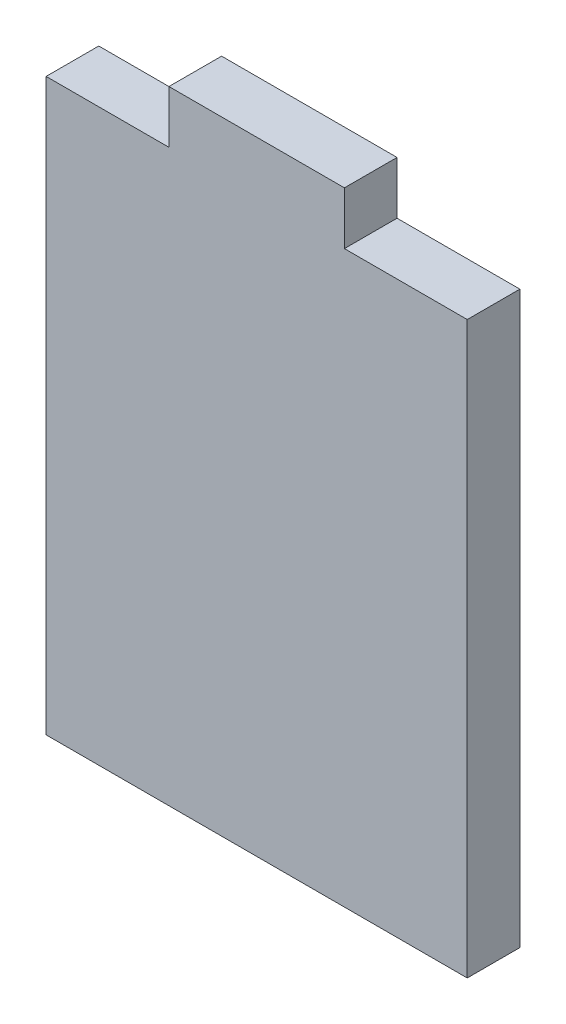
ISO-10303-21;
HEADER;
FILE_DESCRIPTION(('STEP AP214'),'2;1');
FILE_NAME('part.step','',(''),(''),'','','');
FILE_SCHEMA(('AUTOMOTIVE_DESIGN { 1 0 10303 214 1 1 1 1 }'));
ENDSEC;
DATA;
#1=APPLICATION_CONTEXT('core data for automotive mechanical design processes');
#2=APPLICATION_PROTOCOL_DEFINITION('international standard','automotive_design',2000,#1);
#3=PRODUCT_CONTEXT('',#1,'mechanical');
#4=PRODUCT('Part','Part','',(#3));
#5=PRODUCT_RELATED_PRODUCT_CATEGORY('part','',(#4));
#6=PRODUCT_DEFINITION_FORMATION('','',#4);
#7=PRODUCT_DEFINITION_CONTEXT('part definition',#1,'design');
#8=PRODUCT_DEFINITION('design','',#6,#7);
#9=PRODUCT_DEFINITION_SHAPE('','',#8);
#10=(LENGTH_UNIT() NAMED_UNIT(*) SI_UNIT(.MILLI.,.METRE.));
#11=(NAMED_UNIT(*) PLANE_ANGLE_UNIT() SI_UNIT($,.RADIAN.));
#12=(NAMED_UNIT(*) SI_UNIT($,.STERADIAN.) SOLID_ANGLE_UNIT());
#13=UNCERTAINTY_MEASURE_WITH_UNIT(LENGTH_MEASURE(1.E-05),#10,'distance_accuracy_value','');
#14=(GEOMETRIC_REPRESENTATION_CONTEXT(3) GLOBAL_UNCERTAINTY_ASSIGNED_CONTEXT((#13)) GLOBAL_UNIT_ASSIGNED_CONTEXT((#10,
#11,#12)) REPRESENTATION_CONTEXT('',''));
#15=CARTESIAN_POINT('',(0.,0.,0.));
#16=DIRECTION('',(0.,0.,1.));
#17=DIRECTION('',(1.,0.,0.));
#18=AXIS2_PLACEMENT_3D('',#15,#16,#17);
#19=CARTESIAN_POINT('',(-53.4278333333333,35.3166666666667,6.));
#20=DIRECTION('',(0.,-1.,0.));
#21=DIRECTION('',(0.,0.,-1.));
#22=AXIS2_PLACEMENT_3D('',#19,#20,#21);
#23=PLANE('',#22);
#24=DIRECTION('',(0.,0.,1.));
#25=VECTOR('',#24,1.);
#26=CARTESIAN_POINT('',(-39.4278333333333,35.3166666666667,0.));
#27=LINE('',#26,#25);
#28=CARTESIAN_POINT('',(-39.4278333333333,35.3166666666667,0.));
#29=VERTEX_POINT('',#28);
#30=CARTESIAN_POINT('',(-39.4278333333333,35.3166666666667,6.));
#31=VERTEX_POINT('',#30);
#32=EDGE_CURVE('E112',#29,#31,#27,.T.);
#33=ORIENTED_EDGE('',*,*,#32,.F.);
#34=DIRECTION('',(-1.,0.,0.));
#35=VECTOR('',#34,1.);
#36=CARTESIAN_POINT('',(-53.4278333333333,35.3166666666667,0.));
#37=LINE('',#36,#35);
#38=CARTESIAN_POINT('',(-53.4278333333333,35.3166666666667,0.));
#39=VERTEX_POINT('',#38);
#40=EDGE_CURVE('E81',#29,#39,#37,.T.);
#41=ORIENTED_EDGE('',*,*,#40,.T.);
#42=DIRECTION('',(0.,0.,-1.));
#43=VECTOR('',#42,1.);
#44=CARTESIAN_POINT('',(-53.4278333333333,35.3166666666667,6.));
#45=LINE('',#44,#43);
#46=CARTESIAN_POINT('',(-53.4278333333333,35.3166666666667,6.));
#47=VERTEX_POINT('',#46);
#48=EDGE_CURVE('E143',#47,#39,#45,.T.);
#49=ORIENTED_EDGE('',*,*,#48,.F.);
#50=DIRECTION('',(-1.,0.,0.));
#51=VECTOR('',#50,1.);
#52=CARTESIAN_POINT('',(-53.4278333333333,35.3166666666667,6.));
#53=LINE('',#52,#51);
#54=EDGE_CURVE('E59',#31,#47,#53,.T.);
#55=ORIENTED_EDGE('',*,*,#54,.F.);
#56=EDGE_LOOP('',(#33,#41,#49,#55));
#57=FACE_BOUND('',#56,.T.);
#58=ADVANCED_FACE('F33',(#57),#23,.F.);
#59=CARTESIAN_POINT('',(-53.4278333333333,35.3166666666667,6.));
#60=DIRECTION('',(1.,0.,0.));
#61=DIRECTION('',(0.,0.,-1.));
#62=AXIS2_PLACEMENT_3D('',#59,#60,#61);
#63=PLANE('',#62);
#64=DIRECTION('',(0.,-1.,0.));
#65=VECTOR('',#64,1.);
#66=CARTESIAN_POINT('',(-53.4278333333333,35.3166666666667,0.));
#67=LINE('',#66,#65);
#68=CARTESIAN_POINT('',(-53.4278333333333,-29.6833333333333,0.));
#69=VERTEX_POINT('',#68);
#70=EDGE_CURVE('E126',#39,#69,#67,.T.);
#71=ORIENTED_EDGE('',*,*,#70,.T.);
#72=DIRECTION('',(0.,0.,-1.));
#73=VECTOR('',#72,1.);
#74=CARTESIAN_POINT('',(-53.4278333333333,-29.6833333333333,6.));
#75=LINE('',#74,#73);
#76=CARTESIAN_POINT('',(-53.4278333333333,-29.6833333333333,6.));
#77=VERTEX_POINT('',#76);
#78=EDGE_CURVE('E11',#77,#69,#75,.T.);
#79=ORIENTED_EDGE('',*,*,#78,.F.);
#80=DIRECTION('',(0.,-1.,0.));
#81=VECTOR('',#80,1.);
#82=CARTESIAN_POINT('',(-53.4278333333333,35.3166666666667,6.));
#83=LINE('',#82,#81);
#84=EDGE_CURVE('E131',#47,#77,#83,.T.);
#85=ORIENTED_EDGE('',*,*,#84,.F.);
#86=ORIENTED_EDGE('',*,*,#48,.T.);
#87=EDGE_LOOP('',(#71,#79,#85,#86));
#88=FACE_BOUND('',#87,.T.);
#89=ADVANCED_FACE('F35',(#88),#63,.F.);
#90=CARTESIAN_POINT('',(-53.4278333333333,-29.6833333333333,6.));
#91=DIRECTION('',(0.,1.,0.));
#92=DIRECTION('',(0.,0.,1.));
#93=AXIS2_PLACEMENT_3D('',#90,#91,#92);
#94=PLANE('',#93);
#95=DIRECTION('',(1.,0.,0.));
#96=VECTOR('',#95,1.);
#97=CARTESIAN_POINT('',(-53.4278333333333,-29.6833333333333,0.));
#98=LINE('',#97,#96);
#99=CARTESIAN_POINT('',(-5.42783333333333,-29.6833333333333,0.));
#100=VERTEX_POINT('',#99);
#101=EDGE_CURVE('E133',#69,#100,#98,.T.);
#102=ORIENTED_EDGE('',*,*,#101,.T.);
#103=DIRECTION('',(0.,0.,-1.));
#104=VECTOR('',#103,1.);
#105=CARTESIAN_POINT('',(-5.42783333333333,-29.6833333333333,6.));
#106=LINE('',#105,#104);
#107=CARTESIAN_POINT('',(-5.42783333333333,-29.6833333333333,6.));
#108=VERTEX_POINT('',#107);
#109=EDGE_CURVE('E42',#108,#100,#106,.T.);
#110=ORIENTED_EDGE('',*,*,#109,.F.);
#111=DIRECTION('',(1.,0.,0.));
#112=VECTOR('',#111,1.);
#113=CARTESIAN_POINT('',(-53.4278333333333,-29.6833333333333,6.));
#114=LINE('',#113,#112);
#115=EDGE_CURVE('E88',#77,#108,#114,.T.);
#116=ORIENTED_EDGE('',*,*,#115,.F.);
#117=ORIENTED_EDGE('',*,*,#78,.T.);
#118=EDGE_LOOP('',(#102,#110,#116,#117));
#119=FACE_BOUND('',#118,.T.);
#120=ADVANCED_FACE('F170',(#119),#94,.F.);
#121=CARTESIAN_POINT('',(-5.42783333333333,35.3166666666667,6.));
#122=DIRECTION('',(-1.,0.,0.));
#123=DIRECTION('',(0.,-1.,0.));
#124=AXIS2_PLACEMENT_3D('',#121,#122,#123);
#125=PLANE('',#124);
#126=DIRECTION('',(0.,1.,0.));
#127=VECTOR('',#126,1.);
#128=CARTESIAN_POINT('',(-5.42783333333333,35.3166666666667,0.));
#129=LINE('',#128,#127);
#130=CARTESIAN_POINT('',(-5.42783333333333,35.3166666666667,0.));
#131=VERTEX_POINT('',#130);
#132=EDGE_CURVE('E128',#100,#131,#129,.T.);
#133=ORIENTED_EDGE('',*,*,#132,.T.);
#134=DIRECTION('',(0.,0.,-1.));
#135=VECTOR('',#134,1.);
#136=CARTESIAN_POINT('',(-5.42783333333333,35.3166666666667,6.));
#137=LINE('',#136,#135);
#138=CARTESIAN_POINT('',(-5.42783333333333,35.3166666666667,6.));
#139=VERTEX_POINT('',#138);
#140=EDGE_CURVE('E146',#139,#131,#137,.T.);
#141=ORIENTED_EDGE('',*,*,#140,.F.);
#142=DIRECTION('',(0.,1.,0.));
#143=VECTOR('',#142,1.);
#144=CARTESIAN_POINT('',(-5.42783333333333,35.3166666666667,6.));
#145=LINE('',#144,#143);
#146=EDGE_CURVE('E155',#108,#139,#145,.T.);
#147=ORIENTED_EDGE('',*,*,#146,.F.);
#148=ORIENTED_EDGE('',*,*,#109,.T.);
#149=EDGE_LOOP('',(#133,#141,#147,#148));
#150=FACE_BOUND('',#149,.T.);
#151=ADVANCED_FACE('F153',(#150),#125,.F.);
#152=CARTESIAN_POINT('',(-19.4278333333333,35.3166666666667,0.));
#153=VERTEX_POINT('',#152);
#154=EDGE_CURVE('E127',#131,#153,#37,.T.);
#155=ORIENTED_EDGE('',*,*,#154,.T.);
#156=DIRECTION('',(0.,0.,1.));
#157=VECTOR('',#156,1.);
#158=CARTESIAN_POINT('',(-19.4278333333333,35.3166666666667,0.));
#159=LINE('',#158,#157);
#160=CARTESIAN_POINT('',(-19.4278333333333,35.3166666666667,6.));
#161=VERTEX_POINT('',#160);
#162=EDGE_CURVE('E120',#153,#161,#159,.T.);
#163=ORIENTED_EDGE('',*,*,#162,.T.);
#164=EDGE_CURVE('E137',#139,#161,#53,.T.);
#165=ORIENTED_EDGE('',*,*,#164,.F.);
#166=ORIENTED_EDGE('',*,*,#140,.T.);
#167=EDGE_LOOP('',(#155,#163,#165,#166));
#168=FACE_BOUND('',#167,.T.);
#169=ADVANCED_FACE('F160',(#168),#23,.F.);
#170=CARTESIAN_POINT('',(0.,0.,6.));
#171=DIRECTION('',(0.,0.,1.));
#172=DIRECTION('',(1.,0.,0.));
#173=AXIS2_PLACEMENT_3D('',#170,#171,#172);
#174=PLANE('',#173);
#175=ORIENTED_EDGE('',*,*,#84,.T.);
#176=ORIENTED_EDGE('',*,*,#115,.T.);
#177=ORIENTED_EDGE('',*,*,#146,.T.);
#178=ORIENTED_EDGE('',*,*,#164,.T.);
#179=DIRECTION('',(0.,1.,0.));
#180=VECTOR('',#179,1.);
#181=CARTESIAN_POINT('',(-19.4278333333333,35.3166666666667,6.));
#182=LINE('',#181,#180);
#183=CARTESIAN_POINT('',(-19.4278333333333,41.3166666666667,6.));
#184=VERTEX_POINT('',#183);
#185=EDGE_CURVE('E50',#161,#184,#182,.T.);
#186=ORIENTED_EDGE('',*,*,#185,.T.);
#187=DIRECTION('',(-1.,0.,0.));
#188=VECTOR('',#187,1.);
#189=CARTESIAN_POINT('',(-39.4278333333333,41.3166666666667,6.));
#190=LINE('',#189,#188);
#191=CARTESIAN_POINT('',(-39.4278333333333,41.3166666666667,6.));
#192=VERTEX_POINT('',#191);
#193=EDGE_CURVE('E118',#184,#192,#190,.T.);
#194=ORIENTED_EDGE('',*,*,#193,.T.);
#195=DIRECTION('',(0.,-1.,0.));
#196=VECTOR('',#195,1.);
#197=CARTESIAN_POINT('',(-39.4278333333333,35.3166666666667,6.));
#198=LINE('',#197,#196);
#199=EDGE_CURVE('E185',#192,#31,#198,.T.);
#200=ORIENTED_EDGE('',*,*,#199,.T.);
#201=ORIENTED_EDGE('',*,*,#54,.T.);
#202=EDGE_LOOP('',(#175,#176,#177,#178,#186,#194,#200,#201));
#203=FACE_BOUND('',#202,.T.);
#204=ADVANCED_FACE('F213',(#203),#174,.T.);
#205=CARTESIAN_POINT('',(0.,0.,0.));
#206=DIRECTION('',(0.,0.,1.));
#207=DIRECTION('',(1.,0.,0.));
#208=AXIS2_PLACEMENT_3D('',#205,#206,#207);
#209=PLANE('',#208);
#210=ORIENTED_EDGE('',*,*,#70,.F.);
#211=ORIENTED_EDGE('',*,*,#40,.F.);
#212=DIRECTION('',(0.,-1.,0.));
#213=VECTOR('',#212,1.);
#214=CARTESIAN_POINT('',(-39.4278333333333,35.3166666666667,0.));
#215=LINE('',#214,#213);
#216=CARTESIAN_POINT('',(-39.4278333333333,41.3166666666667,0.));
#217=VERTEX_POINT('',#216);
#218=EDGE_CURVE('E109',#217,#29,#215,.T.);
#219=ORIENTED_EDGE('',*,*,#218,.F.);
#220=DIRECTION('',(-1.,0.,0.));
#221=VECTOR('',#220,1.);
#222=CARTESIAN_POINT('',(-39.4278333333333,41.3166666666667,0.));
#223=LINE('',#222,#221);
#224=CARTESIAN_POINT('',(-19.4278333333333,41.3166666666667,0.));
#225=VERTEX_POINT('',#224);
#226=EDGE_CURVE('E121',#225,#217,#223,.T.);
#227=ORIENTED_EDGE('',*,*,#226,.F.);
#228=DIRECTION('',(0.,1.,0.));
#229=VECTOR('',#228,1.);
#230=CARTESIAN_POINT('',(-19.4278333333333,35.3166666666667,0.));
#231=LINE('',#230,#229);
#232=EDGE_CURVE('E117',#153,#225,#231,.T.);
#233=ORIENTED_EDGE('',*,*,#232,.F.);
#234=ORIENTED_EDGE('',*,*,#154,.F.);
#235=ORIENTED_EDGE('',*,*,#132,.F.);
#236=ORIENTED_EDGE('',*,*,#101,.F.);
#237=EDGE_LOOP('',(#210,#211,#219,#227,#233,#234,#235,#236));
#238=FACE_BOUND('',#237,.T.);
#239=ADVANCED_FACE('F124',(#238),#209,.F.);
#240=CARTESIAN_POINT('',(-39.4278333333333,35.3166666666667,0.));
#241=DIRECTION('',(-1.,0.,0.));
#242=DIRECTION('',(0.,0.,1.));
#243=AXIS2_PLACEMENT_3D('',#240,#241,#242);
#244=PLANE('',#243);
#245=ORIENTED_EDGE('',*,*,#199,.F.);
#246=DIRECTION('',(0.,0.,1.));
#247=VECTOR('',#246,1.);
#248=CARTESIAN_POINT('',(-39.4278333333333,41.3166666666667,0.));
#249=LINE('',#248,#247);
#250=EDGE_CURVE('E113',#217,#192,#249,.T.);
#251=ORIENTED_EDGE('',*,*,#250,.F.);
#252=ORIENTED_EDGE('',*,*,#218,.T.);
#253=ORIENTED_EDGE('',*,*,#32,.T.);
#254=EDGE_LOOP('',(#245,#251,#252,#253));
#255=FACE_BOUND('',#254,.T.);
#256=ADVANCED_FACE('F111',(#255),#244,.T.);
#257=CARTESIAN_POINT('',(-39.4278333333333,41.3166666666667,0.));
#258=DIRECTION('',(0.,1.,0.));
#259=DIRECTION('',(0.,0.,1.));
#260=AXIS2_PLACEMENT_3D('',#257,#258,#259);
#261=PLANE('',#260);
#262=ORIENTED_EDGE('',*,*,#193,.F.);
#263=DIRECTION('',(0.,0.,1.));
#264=VECTOR('',#263,1.);
#265=CARTESIAN_POINT('',(-19.4278333333333,41.3166666666667,0.));
#266=LINE('',#265,#264);
#267=EDGE_CURVE('E191',#225,#184,#266,.T.);
#268=ORIENTED_EDGE('',*,*,#267,.F.);
#269=ORIENTED_EDGE('',*,*,#226,.T.);
#270=ORIENTED_EDGE('',*,*,#250,.T.);
#271=EDGE_LOOP('',(#262,#268,#269,#270));
#272=FACE_BOUND('',#271,.T.);
#273=ADVANCED_FACE('F195',(#272),#261,.T.);
#274=CARTESIAN_POINT('',(-19.4278333333333,35.3166666666667,0.));
#275=DIRECTION('',(1.,0.,0.));
#276=DIRECTION('',(0.,0.,-1.));
#277=AXIS2_PLACEMENT_3D('',#274,#275,#276);
#278=PLANE('',#277);
#279=ORIENTED_EDGE('',*,*,#185,.F.);
#280=ORIENTED_EDGE('',*,*,#162,.F.);
#281=ORIENTED_EDGE('',*,*,#232,.T.);
#282=ORIENTED_EDGE('',*,*,#267,.T.);
#283=EDGE_LOOP('',(#279,#280,#281,#282));
#284=FACE_BOUND('',#283,.T.);
#285=ADVANCED_FACE('F197',(#284),#278,.T.);
#286=CLOSED_SHELL('',(#58,#89,#120,#151,#169,#204,#239,#256,#273,#285));
#287=MANIFOLD_SOLID_BREP('B2',#286);
#288=ADVANCED_BREP_SHAPE_REPRESENTATION('',(#18,#287),#14);
#289=SHAPE_DEFINITION_REPRESENTATION(#9,#288);
ENDSEC;
END-ISO-10303-21;
